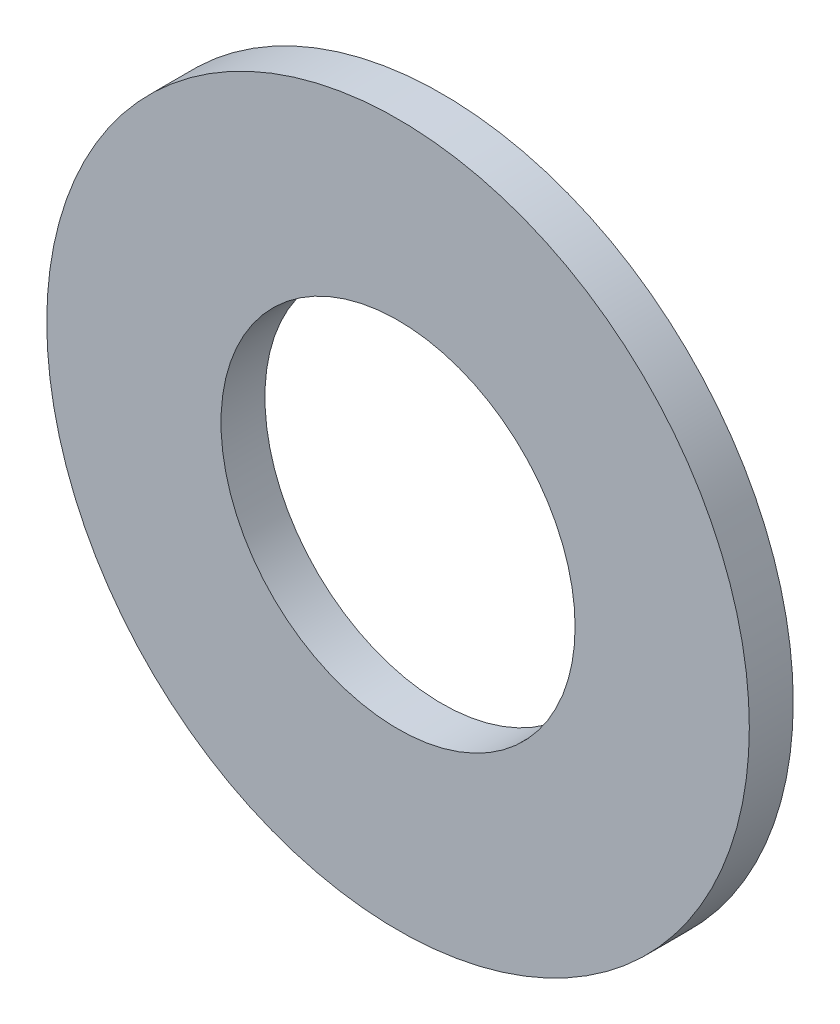
ISO-10303-21;
HEADER;
FILE_DESCRIPTION(('STEP AP214'),'2;1');
FILE_NAME('part.step','',(''),(''),'','','');
FILE_SCHEMA(('AUTOMOTIVE_DESIGN { 1 0 10303 214 1 1 1 1 }'));
ENDSEC;
DATA;
#1=APPLICATION_CONTEXT('core data for automotive mechanical design processes');
#2=APPLICATION_PROTOCOL_DEFINITION('international standard','automotive_design',2000,#1);
#3=PRODUCT_CONTEXT('',#1,'mechanical');
#4=PRODUCT('Part','Part','',(#3));
#5=PRODUCT_RELATED_PRODUCT_CATEGORY('part','',(#4));
#6=PRODUCT_DEFINITION_FORMATION('','',#4);
#7=PRODUCT_DEFINITION_CONTEXT('part definition',#1,'design');
#8=PRODUCT_DEFINITION('design','',#6,#7);
#9=PRODUCT_DEFINITION_SHAPE('','',#8);
#10=(LENGTH_UNIT() NAMED_UNIT(*) SI_UNIT(.MILLI.,.METRE.));
#11=(NAMED_UNIT(*) PLANE_ANGLE_UNIT() SI_UNIT($,.RADIAN.));
#12=(NAMED_UNIT(*) SI_UNIT($,.STERADIAN.) SOLID_ANGLE_UNIT());
#13=UNCERTAINTY_MEASURE_WITH_UNIT(LENGTH_MEASURE(1.E-05),#10,'distance_accuracy_value','');
#14=(GEOMETRIC_REPRESENTATION_CONTEXT(3) GLOBAL_UNCERTAINTY_ASSIGNED_CONTEXT((#13)) GLOBAL_UNIT_ASSIGNED_CONTEXT((#10,
#11,#12)) REPRESENTATION_CONTEXT('',''));
#15=CARTESIAN_POINT('',(0.,0.,0.));
#16=DIRECTION('',(0.,0.,1.));
#17=DIRECTION('',(1.,0.,0.));
#18=AXIS2_PLACEMENT_3D('',#15,#16,#17);
#19=CARTESIAN_POINT('',(0.,0.,0.79375));
#20=DIRECTION('',(0.,0.,1.));
#21=DIRECTION('',(1.,0.,0.));
#22=AXIS2_PLACEMENT_3D('',#19,#20,#21);
#23=PLANE('',#22);
#24=CARTESIAN_POINT('',(0.,0.,0.79375));
#25=DIRECTION('',(0.,0.,1.));
#26=DIRECTION('',(1.,0.,0.));
#27=AXIS2_PLACEMENT_3D('',#24,#25,#26);
#28=CIRCLE('',#27,12.7);
#29=CARTESIAN_POINT('',(12.7,0.,0.79375));
#30=VERTEX_POINT('',#29);
#31=EDGE_CURVE('E10',#30,#30,#28,.T.);
#32=ORIENTED_EDGE('',*,*,#31,.T.);
#33=EDGE_LOOP('',(#32));
#34=FACE_BOUND('',#33,.T.);
#35=CARTESIAN_POINT('',(0.,0.,0.79375));
#36=DIRECTION('',(0.,0.,1.));
#37=DIRECTION('',(1.,0.,0.));
#38=AXIS2_PLACEMENT_3D('',#35,#36,#37);
#39=CIRCLE('',#38,6.4008);
#40=CARTESIAN_POINT('',(6.4008,0.,0.79375));
#41=VERTEX_POINT('',#40);
#42=EDGE_CURVE('E41',#41,#41,#39,.T.);
#43=ORIENTED_EDGE('',*,*,#42,.F.);
#44=EDGE_LOOP('',(#43));
#45=FACE_BOUND('',#44,.T.);
#46=ADVANCED_FACE('F30',(#34,#45),#23,.T.);
#47=CARTESIAN_POINT('',(0.,0.,-0.79375));
#48=DIRECTION('',(0.,0.,1.));
#49=DIRECTION('',(1.,0.,0.));
#50=AXIS2_PLACEMENT_3D('',#47,#48,#49);
#51=PLANE('',#50);
#52=CARTESIAN_POINT('',(0.,0.,-0.79375));
#53=DIRECTION('',(0.,0.,1.));
#54=DIRECTION('',(1.,0.,0.));
#55=AXIS2_PLACEMENT_3D('',#52,#53,#54);
#56=CIRCLE('',#55,12.7);
#57=CARTESIAN_POINT('',(12.7,0.,-0.79375));
#58=VERTEX_POINT('',#57);
#59=EDGE_CURVE('E34',#58,#58,#56,.T.);
#60=ORIENTED_EDGE('',*,*,#59,.F.);
#61=EDGE_LOOP('',(#60));
#62=FACE_BOUND('',#61,.T.);
#63=CARTESIAN_POINT('',(0.,0.,-0.79375));
#64=DIRECTION('',(0.,0.,1.));
#65=DIRECTION('',(1.,0.,0.));
#66=AXIS2_PLACEMENT_3D('',#63,#64,#65);
#67=CIRCLE('',#66,6.4008);
#68=CARTESIAN_POINT('',(6.4008,0.,-0.79375));
#69=VERTEX_POINT('',#68);
#70=EDGE_CURVE('E43',#69,#69,#67,.T.);
#71=ORIENTED_EDGE('',*,*,#70,.T.);
#72=EDGE_LOOP('',(#71));
#73=FACE_BOUND('',#72,.T.);
#74=ADVANCED_FACE('F53',(#62,#73),#51,.F.);
#75=CARTESIAN_POINT('',(0.,0.,0.79375));
#76=DIRECTION('',(0.,0.,-1.));
#77=DIRECTION('',(-1.,0.,0.));
#78=AXIS2_PLACEMENT_3D('',#75,#76,#77);
#79=CYLINDRICAL_SURFACE('',#78,12.7);
#80=ORIENTED_EDGE('',*,*,#31,.F.);
#81=EDGE_LOOP('',(#80));
#82=FACE_BOUND('',#81,.T.);
#83=ORIENTED_EDGE('',*,*,#59,.T.);
#84=EDGE_LOOP('',(#83));
#85=FACE_BOUND('',#84,.T.);
#86=ADVANCED_FACE('F32',(#82,#85),#79,.T.);
#87=CARTESIAN_POINT('',(0.,0.,0.79375));
#88=DIRECTION('',(0.,0.,-1.));
#89=DIRECTION('',(-1.,0.,0.));
#90=AXIS2_PLACEMENT_3D('',#87,#88,#89);
#91=CYLINDRICAL_SURFACE('',#90,6.4008);
#92=ORIENTED_EDGE('',*,*,#42,.T.);
#93=EDGE_LOOP('',(#92));
#94=FACE_BOUND('',#93,.T.);
#95=ORIENTED_EDGE('',*,*,#70,.F.);
#96=EDGE_LOOP('',(#95));
#97=FACE_BOUND('',#96,.T.);
#98=ADVANCED_FACE('F49',(#94,#97),#91,.F.);
#99=CLOSED_SHELL('',(#46,#74,#86,#98));
#100=MANIFOLD_SOLID_BREP('B2',#99);
#101=ADVANCED_BREP_SHAPE_REPRESENTATION('',(#18,#100),#14);
#102=SHAPE_DEFINITION_REPRESENTATION(#9,#101);
ENDSEC;
END-ISO-10303-21;
